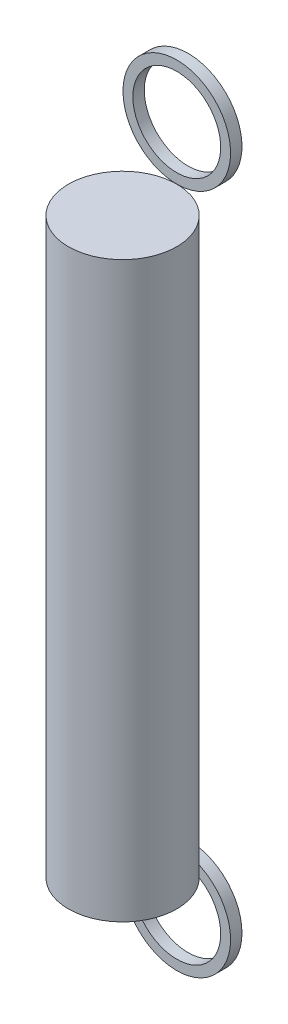
ISO-10303-21;
HEADER;
FILE_DESCRIPTION(('STEP AP214'),'2;1');
FILE_NAME('part.step','',(''),(''),'','','');
FILE_SCHEMA(('AUTOMOTIVE_DESIGN { 1 0 10303 214 1 1 1 1 }'));
ENDSEC;
DATA;
#1=APPLICATION_CONTEXT('core data for automotive mechanical design processes');
#2=APPLICATION_PROTOCOL_DEFINITION('international standard','automotive_design',2000,#1);
#3=PRODUCT_CONTEXT('',#1,'mechanical');
#4=PRODUCT('Part','Part','',(#3));
#5=PRODUCT_RELATED_PRODUCT_CATEGORY('part','',(#4));
#6=PRODUCT_DEFINITION_FORMATION('','',#4);
#7=PRODUCT_DEFINITION_CONTEXT('part definition',#1,'design');
#8=PRODUCT_DEFINITION('design','',#6,#7);
#9=PRODUCT_DEFINITION_SHAPE('','',#8);
#10=(LENGTH_UNIT() NAMED_UNIT(*) SI_UNIT(.MILLI.,.METRE.));
#11=(NAMED_UNIT(*) PLANE_ANGLE_UNIT() SI_UNIT($,.RADIAN.));
#12=(NAMED_UNIT(*) SI_UNIT($,.STERADIAN.) SOLID_ANGLE_UNIT());
#13=UNCERTAINTY_MEASURE_WITH_UNIT(LENGTH_MEASURE(1.E-05),#10,'distance_accuracy_value','');
#14=(GEOMETRIC_REPRESENTATION_CONTEXT(3) GLOBAL_UNCERTAINTY_ASSIGNED_CONTEXT((#13)) GLOBAL_UNIT_ASSIGNED_CONTEXT((#10,
#11,#12)) REPRESENTATION_CONTEXT('',''));
#15=CARTESIAN_POINT('',(0.,0.,0.));
#16=DIRECTION('',(0.,0.,1.));
#17=DIRECTION('',(1.,0.,0.));
#18=AXIS2_PLACEMENT_3D('',#15,#16,#17);
#19=CARTESIAN_POINT('',(0.,-3.4,-4.145));
#20=DIRECTION('',(0.,0.,1.));
#21=DIRECTION('',(1.,0.,0.));
#22=AXIS2_PLACEMENT_3D('',#19,#20,#21);
#23=PLANE('',#22);
#24=CARTESIAN_POINT('',(0.,-3.4,-4.145));
#25=DIRECTION('',(0.,0.,-1.));
#26=DIRECTION('',(1.,0.,0.));
#27=AXIS2_PLACEMENT_3D('',#24,#25,#26);
#28=CIRCLE('',#27,3.4);
#29=CARTESIAN_POINT('',(3.39999999999999,-3.4,-4.145));
#30=VERTEX_POINT('',#29);
#31=EDGE_CURVE('E11',#30,#30,#28,.T.);
#32=ORIENTED_EDGE('',*,*,#31,.T.);
#33=EDGE_LOOP('',(#32));
#34=FACE_BOUND('',#33,.T.);
#35=CARTESIAN_POINT('',(0.,-3.4,-4.145));
#36=DIRECTION('',(0.,0.,-1.));
#37=DIRECTION('',(1.,0.,0.));
#38=AXIS2_PLACEMENT_3D('',#35,#36,#37);
#39=CIRCLE('',#38,2.775);
#40=CARTESIAN_POINT('',(2.77499999999999,-3.4,-4.145));
#41=VERTEX_POINT('',#40);
#42=EDGE_CURVE('E57',#41,#41,#39,.T.);
#43=ORIENTED_EDGE('',*,*,#42,.F.);
#44=EDGE_LOOP('',(#43));
#45=FACE_BOUND('',#44,.T.);
#46=ADVANCED_FACE('F46',(#34,#45),#23,.F.);
#47=CARTESIAN_POINT('',(0.,-3.4,-3.425));
#48=DIRECTION('',(0.,0.,1.));
#49=DIRECTION('',(1.,0.,0.));
#50=AXIS2_PLACEMENT_3D('',#47,#48,#49);
#51=PLANE('',#50);
#52=CARTESIAN_POINT('',(0.,-3.4,-3.425));
#53=DIRECTION('',(0.,0.,-1.));
#54=DIRECTION('',(1.,0.,0.));
#55=AXIS2_PLACEMENT_3D('',#52,#53,#54);
#56=CIRCLE('',#55,3.4);
#57=CARTESIAN_POINT('',(3.39999999999999,-3.4,-3.425));
#58=VERTEX_POINT('',#57);
#59=EDGE_CURVE('E50',#58,#58,#56,.T.);
#60=ORIENTED_EDGE('',*,*,#59,.F.);
#61=EDGE_LOOP('',(#60));
#62=FACE_BOUND('',#61,.T.);
#63=CARTESIAN_POINT('',(0.,-3.4,-3.425));
#64=DIRECTION('',(0.,0.,-1.));
#65=DIRECTION('',(1.,0.,0.));
#66=AXIS2_PLACEMENT_3D('',#63,#64,#65);
#67=CIRCLE('',#66,2.775);
#68=CARTESIAN_POINT('',(2.77499999999999,-3.4,-3.425));
#69=VERTEX_POINT('',#68);
#70=EDGE_CURVE('E59',#69,#69,#67,.T.);
#71=ORIENTED_EDGE('',*,*,#70,.T.);
#72=EDGE_LOOP('',(#71));
#73=FACE_BOUND('',#72,.T.);
#74=ADVANCED_FACE('F69',(#62,#73),#51,.T.);
#75=CARTESIAN_POINT('',(0.,-3.4,-4.145));
#76=DIRECTION('',(0.,0.,1.));
#77=DIRECTION('',(1.,0.,0.));
#78=AXIS2_PLACEMENT_3D('',#75,#76,#77);
#79=CYLINDRICAL_SURFACE('',#78,3.4);
#80=ORIENTED_EDGE('',*,*,#31,.F.);
#81=EDGE_LOOP('',(#80));
#82=FACE_BOUND('',#81,.T.);
#83=ORIENTED_EDGE('',*,*,#59,.T.);
#84=EDGE_LOOP('',(#83));
#85=FACE_BOUND('',#84,.T.);
#86=ADVANCED_FACE('F48',(#82,#85),#79,.T.);
#87=CARTESIAN_POINT('',(0.,-3.4,-4.145));
#88=DIRECTION('',(0.,0.,1.));
#89=DIRECTION('',(1.,0.,0.));
#90=AXIS2_PLACEMENT_3D('',#87,#88,#89);
#91=CYLINDRICAL_SURFACE('',#90,2.775);
#92=ORIENTED_EDGE('',*,*,#42,.T.);
#93=EDGE_LOOP('',(#92));
#94=FACE_BOUND('',#93,.T.);
#95=ORIENTED_EDGE('',*,*,#70,.F.);
#96=EDGE_LOOP('',(#95));
#97=FACE_BOUND('',#96,.T.);
#98=ADVANCED_FACE('F65',(#94,#97),#91,.F.);
#99=CLOSED_SHELL('',(#46,#74,#86,#98));
#100=MANIFOLD_SOLID_BREP('B2',#99);
#101=CARTESIAN_POINT('',(0.,39.65,-4.145));
#102=DIRECTION('',(0.,0.,-1.));
#103=DIRECTION('',(-1.,0.,0.));
#104=AXIS2_PLACEMENT_3D('',#101,#102,#103);
#105=PLANE('',#104);
#106=CARTESIAN_POINT('',(0.,39.65,-4.145));
#107=DIRECTION('',(0.,0.,-1.));
#108=DIRECTION('',(-1.,0.,0.));
#109=AXIS2_PLACEMENT_3D('',#106,#107,#108);
#110=CIRCLE('',#109,3.4);
#111=CARTESIAN_POINT('',(-3.4,39.65,-4.145));
#112=VERTEX_POINT('',#111);
#113=EDGE_CURVE('E45',#112,#112,#110,.T.);
#114=ORIENTED_EDGE('',*,*,#113,.T.);
#115=EDGE_LOOP('',(#114));
#116=FACE_BOUND('',#115,.T.);
#117=CARTESIAN_POINT('',(0.,39.65,-4.145));
#118=DIRECTION('',(0.,0.,-1.));
#119=DIRECTION('',(-1.,0.,0.));
#120=AXIS2_PLACEMENT_3D('',#117,#118,#119);
#121=CIRCLE('',#120,2.775);
#122=CARTESIAN_POINT('',(-2.775,39.65,-4.145));
#123=VERTEX_POINT('',#122);
#124=EDGE_CURVE('E126',#123,#123,#121,.T.);
#125=ORIENTED_EDGE('',*,*,#124,.F.);
#126=EDGE_LOOP('',(#125));
#127=FACE_BOUND('',#126,.T.);
#128=ADVANCED_FACE('F115',(#116,#127),#105,.T.);
#129=CARTESIAN_POINT('',(0.,39.65,-3.425));
#130=DIRECTION('',(0.,0.,-1.));
#131=DIRECTION('',(-1.,0.,0.));
#132=AXIS2_PLACEMENT_3D('',#129,#130,#131);
#133=PLANE('',#132);
#134=CARTESIAN_POINT('',(0.,39.65,-3.425));
#135=DIRECTION('',(0.,0.,-1.));
#136=DIRECTION('',(-1.,0.,0.));
#137=AXIS2_PLACEMENT_3D('',#134,#135,#136);
#138=CIRCLE('',#137,3.4);
#139=CARTESIAN_POINT('',(-3.4,39.65,-3.425));
#140=VERTEX_POINT('',#139);
#141=EDGE_CURVE('E119',#140,#140,#138,.T.);
#142=ORIENTED_EDGE('',*,*,#141,.F.);
#143=EDGE_LOOP('',(#142));
#144=FACE_BOUND('',#143,.T.);
#145=CARTESIAN_POINT('',(0.,39.65,-3.425));
#146=DIRECTION('',(0.,0.,-1.));
#147=DIRECTION('',(-1.,0.,0.));
#148=AXIS2_PLACEMENT_3D('',#145,#146,#147);
#149=CIRCLE('',#148,2.775);
#150=CARTESIAN_POINT('',(-2.775,39.65,-3.425));
#151=VERTEX_POINT('',#150);
#152=EDGE_CURVE('E128',#151,#151,#149,.T.);
#153=ORIENTED_EDGE('',*,*,#152,.T.);
#154=EDGE_LOOP('',(#153));
#155=FACE_BOUND('',#154,.T.);
#156=ADVANCED_FACE('F138',(#144,#155),#133,.F.);
#157=CARTESIAN_POINT('',(0.,39.65,-4.145));
#158=DIRECTION('',(0.,0.,1.));
#159=DIRECTION('',(1.,0.,0.));
#160=AXIS2_PLACEMENT_3D('',#157,#158,#159);
#161=CYLINDRICAL_SURFACE('',#160,3.4);
#162=ORIENTED_EDGE('',*,*,#113,.F.);
#163=EDGE_LOOP('',(#162));
#164=FACE_BOUND('',#163,.T.);
#165=ORIENTED_EDGE('',*,*,#141,.T.);
#166=EDGE_LOOP('',(#165));
#167=FACE_BOUND('',#166,.T.);
#168=ADVANCED_FACE('F117',(#164,#167),#161,.T.);
#169=CARTESIAN_POINT('',(0.,39.65,-4.145));
#170=DIRECTION('',(0.,0.,1.));
#171=DIRECTION('',(1.,0.,0.));
#172=AXIS2_PLACEMENT_3D('',#169,#170,#171);
#173=CYLINDRICAL_SURFACE('',#172,2.775);
#174=ORIENTED_EDGE('',*,*,#124,.T.);
#175=EDGE_LOOP('',(#174));
#176=FACE_BOUND('',#175,.T.);
#177=ORIENTED_EDGE('',*,*,#152,.F.);
#178=EDGE_LOOP('',(#177));
#179=FACE_BOUND('',#178,.T.);
#180=ADVANCED_FACE('F134',(#176,#179),#173,.F.);
#181=CLOSED_SHELL('',(#128,#156,#168,#180));
#182=MANIFOLD_SOLID_BREP('B6',#181);
#183=CARTESIAN_POINT('',(0.,36.25,0.));
#184=DIRECTION('',(0.,-1.,0.));
#185=DIRECTION('',(0.,0.,-1.));
#186=AXIS2_PLACEMENT_3D('',#183,#184,#185);
#187=CYLINDRICAL_SURFACE('',#186,3.425);
#188=CARTESIAN_POINT('',(0.,36.25,0.));
#189=DIRECTION('',(0.,1.,0.));
#190=DIRECTION('',(0.,0.,1.));
#191=AXIS2_PLACEMENT_3D('',#188,#189,#190);
#192=CIRCLE('',#191,3.425);
#193=CARTESIAN_POINT('',(0.,36.25,3.425));
#194=VERTEX_POINT('',#193);
#195=EDGE_CURVE('E114',#194,#194,#192,.T.);
#196=ORIENTED_EDGE('',*,*,#195,.F.);
#197=EDGE_LOOP('',(#196));
#198=FACE_BOUND('',#197,.T.);
#199=CARTESIAN_POINT('',(0.,0.,0.));
#200=DIRECTION('',(0.,1.,0.));
#201=DIRECTION('',(0.,0.,1.));
#202=AXIS2_PLACEMENT_3D('',#199,#200,#201);
#203=CIRCLE('',#202,3.425);
#204=CARTESIAN_POINT('',(0.,0.,3.425));
#205=VERTEX_POINT('',#204);
#206=EDGE_CURVE('E180',#205,#205,#203,.T.);
#207=ORIENTED_EDGE('',*,*,#206,.T.);
#208=EDGE_LOOP('',(#207));
#209=FACE_BOUND('',#208,.T.);
#210=ADVANCED_FACE('F177',(#198,#209),#187,.T.);
#211=CARTESIAN_POINT('',(0.,36.25,0.));
#212=DIRECTION('',(0.,1.,0.));
#213=DIRECTION('',(0.,0.,1.));
#214=AXIS2_PLACEMENT_3D('',#211,#212,#213);
#215=PLANE('',#214);
#216=ORIENTED_EDGE('',*,*,#195,.T.);
#217=EDGE_LOOP('',(#216));
#218=FACE_BOUND('',#217,.T.);
#219=ADVANCED_FACE('F194',(#218),#215,.T.);
#220=CARTESIAN_POINT('',(0.,0.,0.));
#221=DIRECTION('',(0.,1.,0.));
#222=DIRECTION('',(0.,0.,1.));
#223=AXIS2_PLACEMENT_3D('',#220,#221,#222);
#224=PLANE('',#223);
#225=ORIENTED_EDGE('',*,*,#206,.F.);
#226=EDGE_LOOP('',(#225));
#227=FACE_BOUND('',#226,.T.);
#228=ADVANCED_FACE('F192',(#227),#224,.F.);
#229=CLOSED_SHELL('',(#210,#219,#228));
#230=MANIFOLD_SOLID_BREP('B40',#229);
#231=ADVANCED_BREP_SHAPE_REPRESENTATION('',(#18,#100,#182,#230),#14);
#232=SHAPE_DEFINITION_REPRESENTATION(#9,#231);
ENDSEC;
END-ISO-10303-21;
